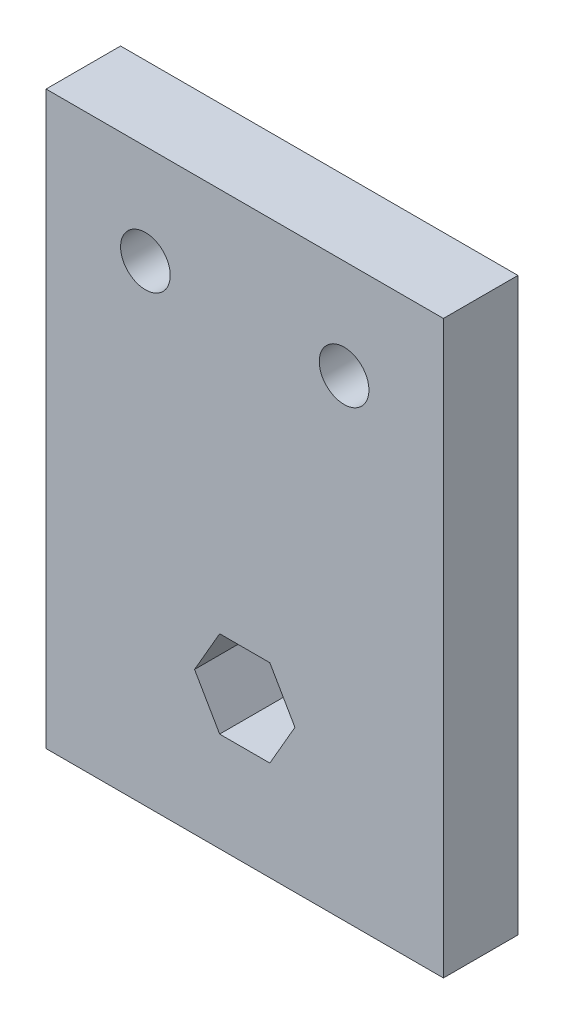
ISO-10303-21;
HEADER;
FILE_DESCRIPTION(('STEP AP214'),'2;1');
FILE_NAME('part.step','',(''),(''),'','','');
FILE_SCHEMA(('AUTOMOTIVE_DESIGN { 1 0 10303 214 1 1 1 1 }'));
ENDSEC;
DATA;
#1=APPLICATION_CONTEXT('core data for automotive mechanical design processes');
#2=APPLICATION_PROTOCOL_DEFINITION('international standard','automotive_design',2000,#1);
#3=PRODUCT_CONTEXT('',#1,'mechanical');
#4=PRODUCT('Part','Part','',(#3));
#5=PRODUCT_RELATED_PRODUCT_CATEGORY('part','',(#4));
#6=PRODUCT_DEFINITION_FORMATION('','',#4);
#7=PRODUCT_DEFINITION_CONTEXT('part definition',#1,'design');
#8=PRODUCT_DEFINITION('design','',#6,#7);
#9=PRODUCT_DEFINITION_SHAPE('','',#8);
#10=(LENGTH_UNIT() NAMED_UNIT(*) SI_UNIT(.MILLI.,.METRE.));
#11=(NAMED_UNIT(*) PLANE_ANGLE_UNIT() SI_UNIT($,.RADIAN.));
#12=(NAMED_UNIT(*) SI_UNIT($,.STERADIAN.) SOLID_ANGLE_UNIT());
#13=UNCERTAINTY_MEASURE_WITH_UNIT(LENGTH_MEASURE(1.E-05),#10,'distance_accuracy_value','');
#14=(GEOMETRIC_REPRESENTATION_CONTEXT(3) GLOBAL_UNCERTAINTY_ASSIGNED_CONTEXT((#13)) GLOBAL_UNIT_ASSIGNED_CONTEXT((#10,
#11,#12)) REPRESENTATION_CONTEXT('',''));
#15=CARTESIAN_POINT('',(0.,0.,0.));
#16=DIRECTION('',(0.,0.,1.));
#17=DIRECTION('',(1.,0.,0.));
#18=AXIS2_PLACEMENT_3D('',#15,#16,#17);
#19=CARTESIAN_POINT('',(0.,73.025,9.525));
#20=DIRECTION('',(0.,0.,-1.));
#21=DIRECTION('',(-1.,0.,0.));
#22=AXIS2_PLACEMENT_3D('',#19,#20,#21);
#23=PLANE('',#22);
#24=CARTESIAN_POINT('',(38.1,60.325,9.525));
#25=DIRECTION('',(0.,0.,1.));
#26=DIRECTION('',(-1.,0.,0.));
#27=AXIS2_PLACEMENT_3D('',#24,#25,#26);
#28=CIRCLE('',#27,3.175);
#29=CARTESIAN_POINT('',(34.925,60.325,9.525));
#30=VERTEX_POINT('',#29);
#31=EDGE_CURVE('E160',#30,#30,#28,.T.);
#32=ORIENTED_EDGE('',*,*,#31,.F.);
#33=EDGE_LOOP('',(#32));
#34=FACE_BOUND('',#33,.T.);
#35=DIRECTION('',(0.,-1.,0.));
#36=VECTOR('',#35,1.);
#37=CARTESIAN_POINT('',(0.,0.,9.525));
#38=LINE('',#37,#36);
#39=CARTESIAN_POINT('',(0.,73.025,9.525));
#40=VERTEX_POINT('',#39);
#41=CARTESIAN_POINT('',(0.,0.,9.525));
#42=VERTEX_POINT('',#41);
#43=EDGE_CURVE('E172',#40,#42,#38,.T.);
#44=ORIENTED_EDGE('',*,*,#43,.T.);
#45=DIRECTION('',(1.,0.,0.));
#46=VECTOR('',#45,1.);
#47=CARTESIAN_POINT('',(0.,0.,9.525));
#48=LINE('',#47,#46);
#49=CARTESIAN_POINT('',(50.8,0.,9.525));
#50=VERTEX_POINT('',#49);
#51=EDGE_CURVE('E175',#42,#50,#48,.T.);
#52=ORIENTED_EDGE('',*,*,#51,.T.);
#53=DIRECTION('',(0.,1.,0.));
#54=VECTOR('',#53,1.);
#55=CARTESIAN_POINT('',(50.8,0.,9.525));
#56=LINE('',#55,#54);
#57=CARTESIAN_POINT('',(50.8,73.025,9.525));
#58=VERTEX_POINT('',#57);
#59=EDGE_CURVE('E178',#50,#58,#56,.T.);
#60=ORIENTED_EDGE('',*,*,#59,.T.);
#61=DIRECTION('',(-1.,0.,0.));
#62=VECTOR('',#61,1.);
#63=CARTESIAN_POINT('',(0.,73.025,9.525));
#64=LINE('',#63,#62);
#65=EDGE_CURVE('E180',#58,#40,#64,.T.);
#66=ORIENTED_EDGE('',*,*,#65,.T.);
#67=EDGE_LOOP('',(#44,#52,#60,#66));
#68=FACE_BOUND('',#67,.T.);
#69=CARTESIAN_POINT('',(12.7,60.325,9.525));
#70=DIRECTION('',(0.,0.,1.));
#71=DIRECTION('',(1.,0.,0.));
#72=AXIS2_PLACEMENT_3D('',#69,#70,#71);
#73=CIRCLE('',#72,3.175);
#74=CARTESIAN_POINT('',(15.875,60.325,9.525));
#75=VERTEX_POINT('',#74);
#76=EDGE_CURVE('E166',#75,#75,#73,.T.);
#77=ORIENTED_EDGE('',*,*,#76,.F.);
#78=EDGE_LOOP('',(#77));
#79=FACE_BOUND('',#78,.T.);
#80=DIRECTION('',(0.5,0.866025403784439,0.));
#81=VECTOR('',#80,1.);
#82=CARTESIAN_POINT('',(28.6079024331849,12.7,9.525));
#83=LINE('',#82,#81);
#84=CARTESIAN_POINT('',(28.6079024331849,12.7,9.525));
#85=VERTEX_POINT('',#84);
#86=CARTESIAN_POINT('',(31.8158048663697,18.25625,9.525));
#87=VERTEX_POINT('',#86);
#88=EDGE_CURVE('E109',#85,#87,#83,.T.);
#89=ORIENTED_EDGE('',*,*,#88,.F.);
#90=DIRECTION('',(1.,0.,0.));
#91=VECTOR('',#90,1.);
#92=CARTESIAN_POINT('',(22.1920975668151,12.7,9.525));
#93=LINE('',#92,#91);
#94=CARTESIAN_POINT('',(22.1920975668151,12.7,9.525));
#95=VERTEX_POINT('',#94);
#96=EDGE_CURVE('E138',#95,#85,#93,.T.);
#97=ORIENTED_EDGE('',*,*,#96,.F.);
#98=DIRECTION('',(0.5,-0.866025403784439,0.));
#99=VECTOR('',#98,1.);
#100=CARTESIAN_POINT('',(18.9841951336303,18.25625,9.525));
#101=LINE('',#100,#99);
#102=CARTESIAN_POINT('',(18.9841951336303,18.25625,9.525));
#103=VERTEX_POINT('',#102);
#104=EDGE_CURVE('E136',#103,#95,#101,.T.);
#105=ORIENTED_EDGE('',*,*,#104,.F.);
#106=DIRECTION('',(-0.5,-0.866025403784439,0.));
#107=VECTOR('',#106,1.);
#108=CARTESIAN_POINT('',(22.1920975668151,23.8125,9.525));
#109=LINE('',#108,#107);
#110=CARTESIAN_POINT('',(22.1920975668151,23.8125,9.525));
#111=VERTEX_POINT('',#110);
#112=EDGE_CURVE('E132',#111,#103,#109,.T.);
#113=ORIENTED_EDGE('',*,*,#112,.F.);
#114=DIRECTION('',(-1.,0.,0.));
#115=VECTOR('',#114,1.);
#116=CARTESIAN_POINT('',(28.6079024331849,23.8125,9.525));
#117=LINE('',#116,#115);
#118=CARTESIAN_POINT('',(28.6079024331849,23.8125,9.525));
#119=VERTEX_POINT('',#118);
#120=EDGE_CURVE('E130',#119,#111,#117,.T.);
#121=ORIENTED_EDGE('',*,*,#120,.F.);
#122=DIRECTION('',(-0.5,0.866025403784439,0.));
#123=VECTOR('',#122,1.);
#124=CARTESIAN_POINT('',(31.8158048663697,18.25625,9.525));
#125=LINE('',#124,#123);
#126=EDGE_CURVE('E117',#87,#119,#125,.T.);
#127=ORIENTED_EDGE('',*,*,#126,.F.);
#128=EDGE_LOOP('',(#89,#97,#105,#113,#121,#127));
#129=FACE_BOUND('',#128,.T.);
#130=ADVANCED_FACE('F32',(#34,#68,#79,#129),#23,.F.);
#131=CARTESIAN_POINT('',(0.,73.025,0.));
#132=DIRECTION('',(0.,0.,-1.));
#133=DIRECTION('',(-1.,0.,0.));
#134=AXIS2_PLACEMENT_3D('',#131,#132,#133);
#135=PLANE('',#134);
#136=CARTESIAN_POINT('',(38.1,60.325,0.));
#137=DIRECTION('',(0.,0.,1.));
#138=DIRECTION('',(-1.,0.,0.));
#139=AXIS2_PLACEMENT_3D('',#136,#137,#138);
#140=CIRCLE('',#139,3.175);
#141=CARTESIAN_POINT('',(34.925,60.325,0.));
#142=VERTEX_POINT('',#141);
#143=EDGE_CURVE('E125',#142,#142,#140,.T.);
#144=ORIENTED_EDGE('',*,*,#143,.T.);
#145=EDGE_LOOP('',(#144));
#146=FACE_BOUND('',#145,.T.);
#147=DIRECTION('',(0.,-1.,0.));
#148=VECTOR('',#147,1.);
#149=CARTESIAN_POINT('',(0.,0.,0.));
#150=LINE('',#149,#148);
#151=CARTESIAN_POINT('',(0.,73.025,0.));
#152=VERTEX_POINT('',#151);
#153=CARTESIAN_POINT('',(0.,0.,0.));
#154=VERTEX_POINT('',#153);
#155=EDGE_CURVE('E169',#152,#154,#150,.T.);
#156=ORIENTED_EDGE('',*,*,#155,.F.);
#157=DIRECTION('',(-1.,0.,0.));
#158=VECTOR('',#157,1.);
#159=CARTESIAN_POINT('',(0.,73.025,0.));
#160=LINE('',#159,#158);
#161=CARTESIAN_POINT('',(50.8,73.025,0.));
#162=VERTEX_POINT('',#161);
#163=EDGE_CURVE('E176',#162,#152,#160,.T.);
#164=ORIENTED_EDGE('',*,*,#163,.F.);
#165=DIRECTION('',(0.,1.,0.));
#166=VECTOR('',#165,1.);
#167=CARTESIAN_POINT('',(50.8,0.,0.));
#168=LINE('',#167,#166);
#169=CARTESIAN_POINT('',(50.8,0.,0.));
#170=VERTEX_POINT('',#169);
#171=EDGE_CURVE('E187',#170,#162,#168,.T.);
#172=ORIENTED_EDGE('',*,*,#171,.F.);
#173=DIRECTION('',(1.,0.,0.));
#174=VECTOR('',#173,1.);
#175=CARTESIAN_POINT('',(0.,0.,0.));
#176=LINE('',#175,#174);
#177=EDGE_CURVE('E185',#154,#170,#176,.T.);
#178=ORIENTED_EDGE('',*,*,#177,.F.);
#179=EDGE_LOOP('',(#156,#164,#172,#178));
#180=FACE_BOUND('',#179,.T.);
#181=CARTESIAN_POINT('',(12.7,60.325,0.));
#182=DIRECTION('',(0.,0.,1.));
#183=DIRECTION('',(1.,0.,0.));
#184=AXIS2_PLACEMENT_3D('',#181,#182,#183);
#185=CIRCLE('',#184,3.175);
#186=CARTESIAN_POINT('',(15.875,60.325,0.));
#187=VERTEX_POINT('',#186);
#188=EDGE_CURVE('E163',#187,#187,#185,.T.);
#189=ORIENTED_EDGE('',*,*,#188,.T.);
#190=EDGE_LOOP('',(#189));
#191=FACE_BOUND('',#190,.T.);
#192=DIRECTION('',(1.,0.,0.));
#193=VECTOR('',#192,1.);
#194=CARTESIAN_POINT('',(22.1920975668151,12.7,0.));
#195=LINE('',#194,#193);
#196=CARTESIAN_POINT('',(22.1920975668151,12.7,0.));
#197=VERTEX_POINT('',#196);
#198=CARTESIAN_POINT('',(28.6079024331849,12.7,0.));
#199=VERTEX_POINT('',#198);
#200=EDGE_CURVE('E118',#197,#199,#195,.T.);
#201=ORIENTED_EDGE('',*,*,#200,.T.);
#202=DIRECTION('',(0.5,0.866025403784439,0.));
#203=VECTOR('',#202,1.);
#204=CARTESIAN_POINT('',(28.6079024331849,12.7,0.));
#205=LINE('',#204,#203);
#206=CARTESIAN_POINT('',(31.8158048663697,18.25625,0.));
#207=VERTEX_POINT('',#206);
#208=EDGE_CURVE('E55',#199,#207,#205,.T.);
#209=ORIENTED_EDGE('',*,*,#208,.T.);
#210=DIRECTION('',(-0.5,0.866025403784439,0.));
#211=VECTOR('',#210,1.);
#212=CARTESIAN_POINT('',(31.8158048663697,18.25625,0.));
#213=LINE('',#212,#211);
#214=CARTESIAN_POINT('',(28.6079024331849,23.8125,0.));
#215=VERTEX_POINT('',#214);
#216=EDGE_CURVE('E124',#207,#215,#213,.T.);
#217=ORIENTED_EDGE('',*,*,#216,.T.);
#218=DIRECTION('',(-1.,0.,0.));
#219=VECTOR('',#218,1.);
#220=CARTESIAN_POINT('',(28.6079024331849,23.8125,0.));
#221=LINE('',#220,#219);
#222=CARTESIAN_POINT('',(22.1920975668151,23.8125,0.));
#223=VERTEX_POINT('',#222);
#224=EDGE_CURVE('E142',#215,#223,#221,.T.);
#225=ORIENTED_EDGE('',*,*,#224,.T.);
#226=DIRECTION('',(-0.5,-0.866025403784439,0.));
#227=VECTOR('',#226,1.);
#228=CARTESIAN_POINT('',(22.1920975668151,23.8125,0.));
#229=LINE('',#228,#227);
#230=CARTESIAN_POINT('',(18.9841951336303,18.25625,0.));
#231=VERTEX_POINT('',#230);
#232=EDGE_CURVE('E145',#223,#231,#229,.T.);
#233=ORIENTED_EDGE('',*,*,#232,.T.);
#234=DIRECTION('',(0.5,-0.866025403784439,0.));
#235=VECTOR('',#234,1.);
#236=CARTESIAN_POINT('',(18.9841951336303,18.25625,0.));
#237=LINE('',#236,#235);
#238=EDGE_CURVE('E148',#231,#197,#237,.T.);
#239=ORIENTED_EDGE('',*,*,#238,.T.);
#240=EDGE_LOOP('',(#201,#209,#217,#225,#233,#239));
#241=FACE_BOUND('',#240,.T.);
#242=ADVANCED_FACE('F205',(#146,#180,#191,#241),#135,.T.);
#243=CARTESIAN_POINT('',(0.,0.,9.525));
#244=DIRECTION('',(1.,0.,0.));
#245=DIRECTION('',(0.,1.,0.));
#246=AXIS2_PLACEMENT_3D('',#243,#244,#245);
#247=PLANE('',#246);
#248=ORIENTED_EDGE('',*,*,#155,.T.);
#249=DIRECTION('',(0.,0.,-1.));
#250=VECTOR('',#249,1.);
#251=CARTESIAN_POINT('',(0.,0.,9.525));
#252=LINE('',#251,#250);
#253=EDGE_CURVE('E11',#42,#154,#252,.T.);
#254=ORIENTED_EDGE('',*,*,#253,.F.);
#255=ORIENTED_EDGE('',*,*,#43,.F.);
#256=DIRECTION('',(0.,0.,-1.));
#257=VECTOR('',#256,1.);
#258=CARTESIAN_POINT('',(0.,73.025,9.525));
#259=LINE('',#258,#257);
#260=EDGE_CURVE('E182',#40,#152,#259,.T.);
#261=ORIENTED_EDGE('',*,*,#260,.T.);
#262=EDGE_LOOP('',(#248,#254,#255,#261));
#263=FACE_BOUND('',#262,.T.);
#264=ADVANCED_FACE('F34',(#263),#247,.F.);
#265=CARTESIAN_POINT('',(0.,0.,9.525));
#266=DIRECTION('',(0.,1.,0.));
#267=DIRECTION('',(0.,0.,1.));
#268=AXIS2_PLACEMENT_3D('',#265,#266,#267);
#269=PLANE('',#268);
#270=ORIENTED_EDGE('',*,*,#177,.T.);
#271=DIRECTION('',(0.,0.,-1.));
#272=VECTOR('',#271,1.);
#273=CARTESIAN_POINT('',(50.8,0.,9.525));
#274=LINE('',#273,#272);
#275=EDGE_CURVE('E40',#50,#170,#274,.T.);
#276=ORIENTED_EDGE('',*,*,#275,.F.);
#277=ORIENTED_EDGE('',*,*,#51,.F.);
#278=ORIENTED_EDGE('',*,*,#253,.T.);
#279=EDGE_LOOP('',(#270,#276,#277,#278));
#280=FACE_BOUND('',#279,.T.);
#281=ADVANCED_FACE('F216',(#280),#269,.F.);
#282=CARTESIAN_POINT('',(50.8,0.,9.525));
#283=DIRECTION('',(-1.,0.,0.));
#284=DIRECTION('',(0.,-1.,0.));
#285=AXIS2_PLACEMENT_3D('',#282,#283,#284);
#286=PLANE('',#285);
#287=ORIENTED_EDGE('',*,*,#171,.T.);
#288=DIRECTION('',(0.,0.,-1.));
#289=VECTOR('',#288,1.);
#290=CARTESIAN_POINT('',(50.8,73.025,9.525));
#291=LINE('',#290,#289);
#292=EDGE_CURVE('E192',#58,#162,#291,.T.);
#293=ORIENTED_EDGE('',*,*,#292,.F.);
#294=ORIENTED_EDGE('',*,*,#59,.F.);
#295=ORIENTED_EDGE('',*,*,#275,.T.);
#296=EDGE_LOOP('',(#287,#293,#294,#295));
#297=FACE_BOUND('',#296,.T.);
#298=ADVANCED_FACE('F199',(#297),#286,.F.);
#299=CARTESIAN_POINT('',(0.,73.025,9.525));
#300=DIRECTION('',(0.,-1.,0.));
#301=DIRECTION('',(0.,0.,-1.));
#302=AXIS2_PLACEMENT_3D('',#299,#300,#301);
#303=PLANE('',#302);
#304=ORIENTED_EDGE('',*,*,#163,.T.);
#305=ORIENTED_EDGE('',*,*,#260,.F.);
#306=ORIENTED_EDGE('',*,*,#65,.F.);
#307=ORIENTED_EDGE('',*,*,#292,.T.);
#308=EDGE_LOOP('',(#304,#305,#306,#307));
#309=FACE_BOUND('',#308,.T.);
#310=ADVANCED_FACE('F209',(#309),#303,.F.);
#311=CARTESIAN_POINT('',(12.7,60.325,9.525));
#312=DIRECTION('',(0.,0.,-1.));
#313=DIRECTION('',(-1.,0.,0.));
#314=AXIS2_PLACEMENT_3D('',#311,#312,#313);
#315=CYLINDRICAL_SURFACE('',#314,3.175);
#316=ORIENTED_EDGE('',*,*,#76,.T.);
#317=EDGE_LOOP('',(#316));
#318=FACE_BOUND('',#317,.T.);
#319=ORIENTED_EDGE('',*,*,#188,.F.);
#320=EDGE_LOOP('',(#319));
#321=FACE_BOUND('',#320,.T.);
#322=ADVANCED_FACE('F233',(#318,#321),#315,.F.);
#323=CARTESIAN_POINT('',(38.1,60.325,9.525));
#324=DIRECTION('',(0.,0.,-1.));
#325=DIRECTION('',(-1.,0.,0.));
#326=AXIS2_PLACEMENT_3D('',#323,#324,#325);
#327=CYLINDRICAL_SURFACE('',#326,3.175);
#328=ORIENTED_EDGE('',*,*,#31,.T.);
#329=EDGE_LOOP('',(#328));
#330=FACE_BOUND('',#329,.T.);
#331=ORIENTED_EDGE('',*,*,#143,.F.);
#332=EDGE_LOOP('',(#331));
#333=FACE_BOUND('',#332,.T.);
#334=ADVANCED_FACE('F240',(#330,#333),#327,.F.);
#335=CARTESIAN_POINT('',(28.6079024331849,12.7,9.525));
#336=DIRECTION('',(-0.866025403784439,0.5,0.));
#337=DIRECTION('',(-0.5,-0.866025403784439,0.));
#338=AXIS2_PLACEMENT_3D('',#335,#336,#337);
#339=PLANE('',#338);
#340=ORIENTED_EDGE('',*,*,#208,.F.);
#341=DIRECTION('',(0.,0.,-1.));
#342=VECTOR('',#341,1.);
#343=CARTESIAN_POINT('',(28.6079024331849,12.7,9.525));
#344=LINE('',#343,#342);
#345=EDGE_CURVE('E113',#85,#199,#344,.T.);
#346=ORIENTED_EDGE('',*,*,#345,.F.);
#347=ORIENTED_EDGE('',*,*,#88,.T.);
#348=DIRECTION('',(0.,0.,-1.));
#349=VECTOR('',#348,1.);
#350=CARTESIAN_POINT('',(31.8158048663697,18.25625,9.525));
#351=LINE('',#350,#349);
#352=EDGE_CURVE('E112',#87,#207,#351,.T.);
#353=ORIENTED_EDGE('',*,*,#352,.T.);
#354=EDGE_LOOP('',(#340,#346,#347,#353));
#355=FACE_BOUND('',#354,.T.);
#356=ADVANCED_FACE('F111',(#355),#339,.T.);
#357=CARTESIAN_POINT('',(31.8158048663697,18.25625,9.525));
#358=DIRECTION('',(-0.866025403784438,-0.5,0.));
#359=DIRECTION('',(0.5,-0.866025403784438,0.));
#360=AXIS2_PLACEMENT_3D('',#357,#358,#359);
#361=PLANE('',#360);
#362=ORIENTED_EDGE('',*,*,#216,.F.);
#363=ORIENTED_EDGE('',*,*,#352,.F.);
#364=ORIENTED_EDGE('',*,*,#126,.T.);
#365=DIRECTION('',(0.,0.,-1.));
#366=VECTOR('',#365,1.);
#367=CARTESIAN_POINT('',(28.6079024331849,23.8125,9.525));
#368=LINE('',#367,#366);
#369=EDGE_CURVE('E126',#119,#215,#368,.T.);
#370=ORIENTED_EDGE('',*,*,#369,.T.);
#371=EDGE_LOOP('',(#362,#363,#364,#370));
#372=FACE_BOUND('',#371,.T.);
#373=ADVANCED_FACE('F121',(#372),#361,.T.);
#374=CARTESIAN_POINT('',(28.6079024331849,23.8125,9.525));
#375=DIRECTION('',(0.,-1.,0.));
#376=DIRECTION('',(0.,0.,-1.));
#377=AXIS2_PLACEMENT_3D('',#374,#375,#376);
#378=PLANE('',#377);
#379=ORIENTED_EDGE('',*,*,#224,.F.);
#380=ORIENTED_EDGE('',*,*,#369,.F.);
#381=ORIENTED_EDGE('',*,*,#120,.T.);
#382=DIRECTION('',(0.,0.,-1.));
#383=VECTOR('',#382,1.);
#384=CARTESIAN_POINT('',(22.1920975668151,23.8125,9.525));
#385=LINE('',#384,#383);
#386=EDGE_CURVE('E157',#111,#223,#385,.T.);
#387=ORIENTED_EDGE('',*,*,#386,.T.);
#388=EDGE_LOOP('',(#379,#380,#381,#387));
#389=FACE_BOUND('',#388,.T.);
#390=ADVANCED_FACE('F262',(#389),#378,.T.);
#391=CARTESIAN_POINT('',(22.1920975668151,23.8125,9.525));
#392=DIRECTION('',(0.866025403784438,-0.5,0.));
#393=DIRECTION('',(0.5,0.866025403784438,0.));
#394=AXIS2_PLACEMENT_3D('',#391,#392,#393);
#395=PLANE('',#394);
#396=ORIENTED_EDGE('',*,*,#232,.F.);
#397=ORIENTED_EDGE('',*,*,#386,.F.);
#398=ORIENTED_EDGE('',*,*,#112,.T.);
#399=DIRECTION('',(0.,0.,-1.));
#400=VECTOR('',#399,1.);
#401=CARTESIAN_POINT('',(18.9841951336303,18.25625,9.525));
#402=LINE('',#401,#400);
#403=EDGE_CURVE('E155',#103,#231,#402,.T.);
#404=ORIENTED_EDGE('',*,*,#403,.T.);
#405=EDGE_LOOP('',(#396,#397,#398,#404));
#406=FACE_BOUND('',#405,.T.);
#407=ADVANCED_FACE('F258',(#406),#395,.T.);
#408=CARTESIAN_POINT('',(18.9841951336303,18.25625,9.525));
#409=DIRECTION('',(0.866025403784439,0.5,0.));
#410=DIRECTION('',(-0.5,0.866025403784439,0.));
#411=AXIS2_PLACEMENT_3D('',#408,#409,#410);
#412=PLANE('',#411);
#413=ORIENTED_EDGE('',*,*,#238,.F.);
#414=ORIENTED_EDGE('',*,*,#403,.F.);
#415=ORIENTED_EDGE('',*,*,#104,.T.);
#416=DIRECTION('',(0.,0.,-1.));
#417=VECTOR('',#416,1.);
#418=CARTESIAN_POINT('',(22.1920975668151,12.7,9.525));
#419=LINE('',#418,#417);
#420=EDGE_CURVE('E47',#95,#197,#419,.T.);
#421=ORIENTED_EDGE('',*,*,#420,.T.);
#422=EDGE_LOOP('',(#413,#414,#415,#421));
#423=FACE_BOUND('',#422,.T.);
#424=ADVANCED_FACE('F255',(#423),#412,.T.);
#425=CARTESIAN_POINT('',(22.1920975668151,12.7,9.525));
#426=DIRECTION('',(0.,1.,0.));
#427=DIRECTION('',(0.,0.,1.));
#428=AXIS2_PLACEMENT_3D('',#425,#426,#427);
#429=PLANE('',#428);
#430=ORIENTED_EDGE('',*,*,#200,.F.);
#431=ORIENTED_EDGE('',*,*,#420,.F.);
#432=ORIENTED_EDGE('',*,*,#96,.T.);
#433=ORIENTED_EDGE('',*,*,#345,.T.);
#434=EDGE_LOOP('',(#430,#431,#432,#433));
#435=FACE_BOUND('',#434,.T.);
#436=ADVANCED_FACE('F251',(#435),#429,.T.);
#437=CLOSED_SHELL('',(#130,#242,#264,#281,#298,#310,#322,#334,#356,#373,#390,#407,#424,#436));
#438=MANIFOLD_SOLID_BREP('B2',#437);
#439=ADVANCED_BREP_SHAPE_REPRESENTATION('',(#18,#438),#14);
#440=SHAPE_DEFINITION_REPRESENTATION(#9,#439);
ENDSEC;
END-ISO-10303-21;
